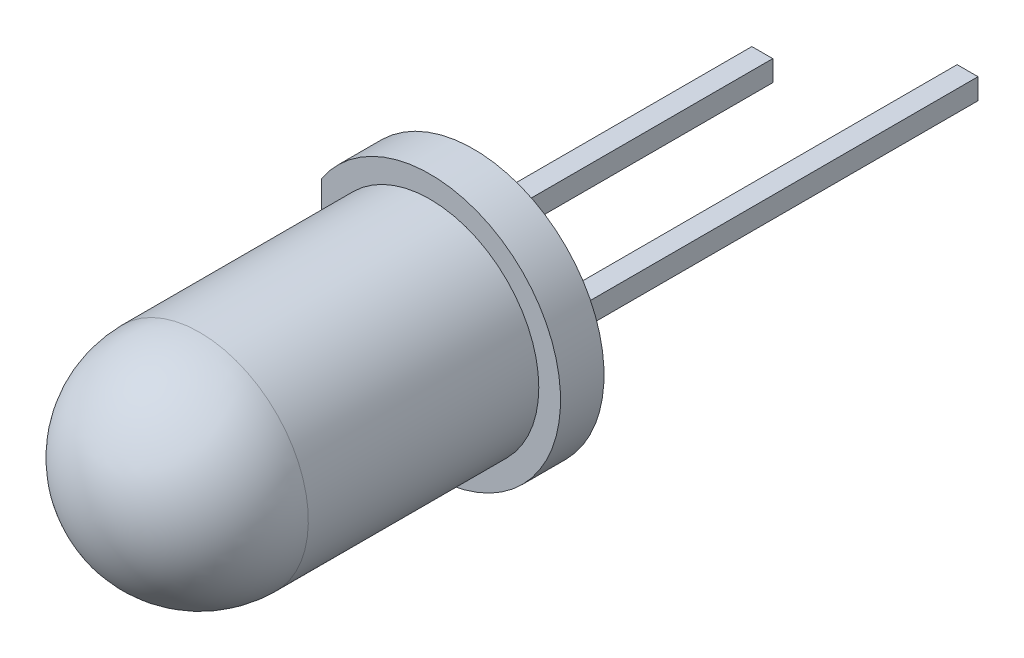
ISO-10303-21;
HEADER;
FILE_DESCRIPTION(('STEP AP214'),'2;1');
FILE_NAME('part.step','',(''),(''),'','','');
FILE_SCHEMA(('AUTOMOTIVE_DESIGN { 1 0 10303 214 1 1 1 1 }'));
ENDSEC;
DATA;
#1=APPLICATION_CONTEXT('core data for automotive mechanical design processes');
#2=APPLICATION_PROTOCOL_DEFINITION('international standard','automotive_design',2000,#1);
#3=PRODUCT_CONTEXT('',#1,'mechanical');
#4=PRODUCT('Part','Part','',(#3));
#5=PRODUCT_RELATED_PRODUCT_CATEGORY('part','',(#4));
#6=PRODUCT_DEFINITION_FORMATION('','',#4);
#7=PRODUCT_DEFINITION_CONTEXT('part definition',#1,'design');
#8=PRODUCT_DEFINITION('design','',#6,#7);
#9=PRODUCT_DEFINITION_SHAPE('','',#8);
#10=(LENGTH_UNIT() NAMED_UNIT(*) SI_UNIT(.MILLI.,.METRE.));
#11=(NAMED_UNIT(*) PLANE_ANGLE_UNIT() SI_UNIT($,.RADIAN.));
#12=(NAMED_UNIT(*) SI_UNIT($,.STERADIAN.) SOLID_ANGLE_UNIT());
#13=UNCERTAINTY_MEASURE_WITH_UNIT(LENGTH_MEASURE(1.E-05),#10,'distance_accuracy_value','');
#14=(GEOMETRIC_REPRESENTATION_CONTEXT(3) GLOBAL_UNCERTAINTY_ASSIGNED_CONTEXT((#13)) GLOBAL_UNIT_ASSIGNED_CONTEXT((#10,
#11,#12)) REPRESENTATION_CONTEXT('',''));
#15=CARTESIAN_POINT('',(0.,0.,0.));
#16=DIRECTION('',(0.,0.,1.));
#17=DIRECTION('',(1.,0.,0.));
#18=AXIS2_PLACEMENT_3D('',#15,#16,#17);
#19=CARTESIAN_POINT('',(-0.0499999999999997,0.,4.26666666666667));
#20=DIRECTION('',(0.,0.,1.));
#21=DIRECTION('',(-1.,0.,0.));
#22=AXIS2_PLACEMENT_3D('',#19,#20,#21);
#23=SPHERICAL_SURFACE('',#22,0.566666666666667);
#24=CARTESIAN_POINT('',(-0.0499999999999997,-0.24,4.26666666666667));
#25=DIRECTION('',(0.,1.,0.));
#26=DIRECTION('',(0.,0.,1.));
#27=AXIS2_PLACEMENT_3D('',#24,#25,#26);
#28=CIRCLE('',#27,0.513333333333333);
#29=CARTESIAN_POINT('',(-0.488634243989226,-0.24,4.));
#30=VERTEX_POINT('',#29);
#31=CARTESIAN_POINT('',(0.388634243989226,-0.24,4.));
#32=VERTEX_POINT('',#31);
#33=EDGE_CURVE('E188',#30,#32,#28,.F.);
#34=ORIENTED_EDGE('',*,*,#33,.T.);
#35=CARTESIAN_POINT('',(-0.0499999999999997,0.,4.));
#36=DIRECTION('',(0.,0.,1.));
#37=DIRECTION('',(1.,0.,0.));
#38=AXIS2_PLACEMENT_3D('',#35,#36,#37);
#39=CIRCLE('',#38,0.5);
#40=EDGE_CURVE('E67',#30,#32,#39,.T.);
#41=ORIENTED_EDGE('',*,*,#40,.F.);
#42=EDGE_LOOP('',(#34,#41));
#43=FACE_BOUND('',#42,.T.);
#44=ADVANCED_FACE('F58',(#43),#23,.T.);
#45=CARTESIAN_POINT('',(0.388634243989226,0.24,4.));
#46=VERTEX_POINT('',#45);
#47=CARTESIAN_POINT('',(-0.488634243989226,0.24,4.));
#48=VERTEX_POINT('',#47);
#49=EDGE_CURVE('E12',#46,#48,#39,.T.);
#50=ORIENTED_EDGE('',*,*,#49,.F.);
#51=CARTESIAN_POINT('',(-0.0499999999999997,0.24,4.26666666666667));
#52=DIRECTION('',(0.,1.,0.));
#53=DIRECTION('',(0.,0.,1.));
#54=AXIS2_PLACEMENT_3D('',#51,#52,#53);
#55=CIRCLE('',#54,0.513333333333333);
#56=EDGE_CURVE('E214',#48,#46,#55,.F.);
#57=ORIENTED_EDGE('',*,*,#56,.F.);
#58=EDGE_LOOP('',(#50,#57));
#59=FACE_BOUND('',#58,.T.);
#60=ADVANCED_FACE('F60',(#59),#23,.T.);
#61=CARTESIAN_POINT('',(-0.55,0.,4.));
#62=DIRECTION('',(0.,0.,-1.));
#63=DIRECTION('',(-1.,0.,0.));
#64=AXIS2_PLACEMENT_3D('',#61,#62,#63);
#65=PLANE('',#64);
#66=CARTESIAN_POINT('',(-0.0499999999999997,0.,4.));
#67=DIRECTION('',(0.,0.,1.));
#68=DIRECTION('',(1.,0.,0.));
#69=AXIS2_PLACEMENT_3D('',#66,#67,#68);
#70=CIRCLE('',#69,0.2);
#71=CARTESIAN_POINT('',(0.15,0.,4.));
#72=VERTEX_POINT('',#71);
#73=EDGE_CURVE('E250',#72,#72,#70,.T.);
#74=ORIENTED_EDGE('',*,*,#73,.F.);
#75=EDGE_LOOP('',(#74));
#76=FACE_BOUND('',#75,.T.);
#77=ORIENTED_EDGE('',*,*,#49,.T.);
#78=DIRECTION('',(1.,0.,0.));
#79=VECTOR('',#78,1.);
#80=CARTESIAN_POINT('',(-1.3,0.24,4.));
#81=LINE('',#80,#79);
#82=CARTESIAN_POINT('',(-1.3,0.24,4.));
#83=VERTEX_POINT('',#82);
#84=EDGE_CURVE('E113',#83,#48,#81,.T.);
#85=ORIENTED_EDGE('',*,*,#84,.F.);
#86=DIRECTION('',(0.,-1.,0.));
#87=VECTOR('',#86,1.);
#88=CARTESIAN_POINT('',(-1.3,0.24,4.));
#89=LINE('',#88,#87);
#90=CARTESIAN_POINT('',(-1.3,-0.24,4.));
#91=VERTEX_POINT('',#90);
#92=EDGE_CURVE('E186',#83,#91,#89,.T.);
#93=ORIENTED_EDGE('',*,*,#92,.T.);
#94=DIRECTION('',(1.,0.,0.));
#95=VECTOR('',#94,1.);
#96=CARTESIAN_POINT('',(-1.3,-0.24,4.));
#97=LINE('',#96,#95);
#98=EDGE_CURVE('E74',#91,#30,#97,.T.);
#99=ORIENTED_EDGE('',*,*,#98,.T.);
#100=ORIENTED_EDGE('',*,*,#40,.T.);
#101=CARTESIAN_POINT('',(1.2,-0.24,4.));
#102=VERTEX_POINT('',#101);
#103=EDGE_CURVE('E165',#32,#102,#97,.T.);
#104=ORIENTED_EDGE('',*,*,#103,.T.);
#105=DIRECTION('',(0.,-1.,0.));
#106=VECTOR('',#105,1.);
#107=CARTESIAN_POINT('',(1.2,0.24,4.));
#108=LINE('',#107,#106);
#109=CARTESIAN_POINT('',(1.2,0.24,4.));
#110=VERTEX_POINT('',#109);
#111=EDGE_CURVE('E143',#110,#102,#108,.T.);
#112=ORIENTED_EDGE('',*,*,#111,.F.);
#113=EDGE_CURVE('E129',#46,#110,#81,.T.);
#114=ORIENTED_EDGE('',*,*,#113,.F.);
#115=EDGE_LOOP('',(#77,#85,#93,#99,#100,#104,#112,#114));
#116=FACE_BOUND('',#115,.T.);
#117=ADVANCED_FACE('F197',(#76,#116),#65,.F.);
#118=CARTESIAN_POINT('',(0.,0.24,0.));
#119=DIRECTION('',(0.,1.,0.));
#120=DIRECTION('',(0.,0.,1.));
#121=AXIS2_PLACEMENT_3D('',#118,#119,#120);
#122=PLANE('',#121);
#123=ORIENTED_EDGE('',*,*,#84,.T.);
#124=ORIENTED_EDGE('',*,*,#56,.T.);
#125=ORIENTED_EDGE('',*,*,#113,.T.);
#126=DIRECTION('',(-0.508148861978286,0.,-0.861269257590315));
#127=VECTOR('',#126,1.);
#128=CARTESIAN_POINT('',(1.2,0.24,4.));
#129=LINE('',#128,#127);
#130=CARTESIAN_POINT('',(0.0199999999999998,0.24,2.));
#131=VERTEX_POINT('',#130);
#132=EDGE_CURVE('E120',#110,#131,#129,.T.);
#133=ORIENTED_EDGE('',*,*,#132,.T.);
#134=DIRECTION('',(-1.,0.,0.));
#135=VECTOR('',#134,1.);
#136=CARTESIAN_POINT('',(0.0199999999999998,0.24,2.));
#137=LINE('',#136,#135);
#138=CARTESIAN_POINT('',(-1.12,0.24,2.));
#139=VERTEX_POINT('',#138);
#140=EDGE_CURVE('E125',#131,#139,#137,.T.);
#141=ORIENTED_EDGE('',*,*,#140,.T.);
#142=DIRECTION('',(0.,0.,-1.));
#143=VECTOR('',#142,1.);
#144=CARTESIAN_POINT('',(-1.12,0.24,2.));
#145=LINE('',#144,#143);
#146=CARTESIAN_POINT('',(-1.12,0.24,-8.));
#147=VERTEX_POINT('',#146);
#148=EDGE_CURVE('E150',#139,#147,#145,.T.);
#149=ORIENTED_EDGE('',*,*,#148,.T.);
#150=DIRECTION('',(1.,0.,0.));
#151=VECTOR('',#150,1.);
#152=CARTESIAN_POINT('',(-1.12,0.24,-8.));
#153=LINE('',#152,#151);
#154=CARTESIAN_POINT('',(-1.6,0.24,-8.));
#155=VERTEX_POINT('',#154);
#156=EDGE_CURVE('E166',#155,#147,#153,.T.);
#157=ORIENTED_EDGE('',*,*,#156,.F.);
#158=DIRECTION('',(0.,0.,1.));
#159=VECTOR('',#158,1.);
#160=CARTESIAN_POINT('',(-1.6,0.24,0.));
#161=LINE('',#160,#159);
#162=CARTESIAN_POINT('',(-1.6,0.24,3.5));
#163=VERTEX_POINT('',#162);
#164=EDGE_CURVE('E83',#155,#163,#161,.T.);
#165=ORIENTED_EDGE('',*,*,#164,.T.);
#166=DIRECTION('',(0.514495755427526,0.,0.857492925712544));
#167=VECTOR('',#166,1.);
#168=CARTESIAN_POINT('',(-1.6,0.24,3.5));
#169=LINE('',#168,#167);
#170=EDGE_CURVE('E179',#163,#83,#169,.T.);
#171=ORIENTED_EDGE('',*,*,#170,.T.);
#172=EDGE_LOOP('',(#123,#124,#125,#133,#141,#149,#157,#165,#171));
#173=FACE_BOUND('',#172,.T.);
#174=ADVANCED_FACE('F122',(#173),#122,.T.);
#175=CARTESIAN_POINT('',(0.,-0.24,0.));
#176=DIRECTION('',(0.,1.,0.));
#177=DIRECTION('',(0.,0.,1.));
#178=AXIS2_PLACEMENT_3D('',#175,#176,#177);
#179=PLANE('',#178);
#180=ORIENTED_EDGE('',*,*,#33,.F.);
#181=ORIENTED_EDGE('',*,*,#98,.F.);
#182=DIRECTION('',(0.514495755427526,0.,0.857492925712544));
#183=VECTOR('',#182,1.);
#184=CARTESIAN_POINT('',(-1.6,-0.24,3.5));
#185=LINE('',#184,#183);
#186=CARTESIAN_POINT('',(-1.6,-0.24,3.5));
#187=VERTEX_POINT('',#186);
#188=EDGE_CURVE('E161',#187,#91,#185,.T.);
#189=ORIENTED_EDGE('',*,*,#188,.F.);
#190=DIRECTION('',(0.,0.,1.));
#191=VECTOR('',#190,1.);
#192=CARTESIAN_POINT('',(-1.6,-0.24,0.));
#193=LINE('',#192,#191);
#194=CARTESIAN_POINT('',(-1.6,-0.24,-8.));
#195=VERTEX_POINT('',#194);
#196=EDGE_CURVE('E107',#195,#187,#193,.T.);
#197=ORIENTED_EDGE('',*,*,#196,.F.);
#198=DIRECTION('',(-1.,0.,0.));
#199=VECTOR('',#198,1.);
#200=CARTESIAN_POINT('',(-1.12,-0.24,-8.));
#201=LINE('',#200,#199);
#202=CARTESIAN_POINT('',(-1.12,-0.24,-8.));
#203=VERTEX_POINT('',#202);
#204=EDGE_CURVE('E235',#203,#195,#201,.T.);
#205=ORIENTED_EDGE('',*,*,#204,.F.);
#206=DIRECTION('',(0.,0.,-1.));
#207=VECTOR('',#206,1.);
#208=CARTESIAN_POINT('',(-1.12,-0.24,2.));
#209=LINE('',#208,#207);
#210=CARTESIAN_POINT('',(-1.12,-0.24,2.));
#211=VERTEX_POINT('',#210);
#212=EDGE_CURVE('E173',#211,#203,#209,.T.);
#213=ORIENTED_EDGE('',*,*,#212,.F.);
#214=DIRECTION('',(-1.,0.,0.));
#215=VECTOR('',#214,1.);
#216=CARTESIAN_POINT('',(0.0199999999999998,-0.24,2.));
#217=LINE('',#216,#215);
#218=CARTESIAN_POINT('',(0.0199999999999998,-0.24,2.));
#219=VERTEX_POINT('',#218);
#220=EDGE_CURVE('E170',#219,#211,#217,.T.);
#221=ORIENTED_EDGE('',*,*,#220,.F.);
#222=DIRECTION('',(-0.508148861978286,0.,-0.861269257590315));
#223=VECTOR('',#222,1.);
#224=CARTESIAN_POINT('',(1.2,-0.24,4.));
#225=LINE('',#224,#223);
#226=EDGE_CURVE('E139',#102,#219,#225,.T.);
#227=ORIENTED_EDGE('',*,*,#226,.F.);
#228=ORIENTED_EDGE('',*,*,#103,.F.);
#229=EDGE_LOOP('',(#180,#181,#189,#197,#205,#213,#221,#227,#228));
#230=FACE_BOUND('',#229,.T.);
#231=ADVANCED_FACE('F274',(#230),#179,.F.);
#232=CARTESIAN_POINT('',(-1.6,0.24,3.5));
#233=DIRECTION('',(0.857492925712544,0.,-0.514495755427526));
#234=DIRECTION('',(-0.514495755427526,0.,-0.857492925712544));
#235=AXIS2_PLACEMENT_3D('',#232,#233,#234);
#236=PLANE('',#235);
#237=ORIENTED_EDGE('',*,*,#188,.T.);
#238=ORIENTED_EDGE('',*,*,#92,.F.);
#239=ORIENTED_EDGE('',*,*,#170,.F.);
#240=DIRECTION('',(0.,-1.,0.));
#241=VECTOR('',#240,1.);
#242=CARTESIAN_POINT('',(-1.6,0.24,3.5));
#243=LINE('',#242,#241);
#244=EDGE_CURVE('E160',#163,#187,#243,.T.);
#245=ORIENTED_EDGE('',*,*,#244,.T.);
#246=EDGE_LOOP('',(#237,#238,#239,#245));
#247=FACE_BOUND('',#246,.T.);
#248=ADVANCED_FACE('F277',(#247),#236,.F.);
#249=CARTESIAN_POINT('',(1.2,0.24,4.));
#250=DIRECTION('',(-0.861269257590315,0.,0.508148861978286));
#251=DIRECTION('',(0.508148861978286,0.,0.861269257590315));
#252=AXIS2_PLACEMENT_3D('',#249,#250,#251);
#253=PLANE('',#252);
#254=ORIENTED_EDGE('',*,*,#226,.T.);
#255=DIRECTION('',(0.,-1.,0.));
#256=VECTOR('',#255,1.);
#257=CARTESIAN_POINT('',(0.0199999999999998,0.24,2.));
#258=LINE('',#257,#256);
#259=EDGE_CURVE('E136',#131,#219,#258,.T.);
#260=ORIENTED_EDGE('',*,*,#259,.F.);
#261=ORIENTED_EDGE('',*,*,#132,.F.);
#262=ORIENTED_EDGE('',*,*,#111,.T.);
#263=EDGE_LOOP('',(#254,#260,#261,#262));
#264=FACE_BOUND('',#263,.T.);
#265=ADVANCED_FACE('F137',(#264),#253,.F.);
#266=CARTESIAN_POINT('',(0.0199999999999998,0.24,2.));
#267=DIRECTION('',(0.,0.,1.));
#268=DIRECTION('',(1.,0.,0.));
#269=AXIS2_PLACEMENT_3D('',#266,#267,#268);
#270=PLANE('',#269);
#271=ORIENTED_EDGE('',*,*,#220,.T.);
#272=DIRECTION('',(0.,-1.,0.));
#273=VECTOR('',#272,1.);
#274=CARTESIAN_POINT('',(-1.12,0.24,2.));
#275=LINE('',#274,#273);
#276=EDGE_CURVE('E144',#139,#211,#275,.T.);
#277=ORIENTED_EDGE('',*,*,#276,.F.);
#278=ORIENTED_EDGE('',*,*,#140,.F.);
#279=ORIENTED_EDGE('',*,*,#259,.T.);
#280=EDGE_LOOP('',(#271,#277,#278,#279));
#281=FACE_BOUND('',#280,.T.);
#282=ADVANCED_FACE('F146',(#281),#270,.F.);
#283=CARTESIAN_POINT('',(-1.12,0.24,2.));
#284=DIRECTION('',(-1.,0.,0.));
#285=DIRECTION('',(0.,0.,1.));
#286=AXIS2_PLACEMENT_3D('',#283,#284,#285);
#287=PLANE('',#286);
#288=ORIENTED_EDGE('',*,*,#212,.T.);
#289=DIRECTION('',(0.,-1.,0.));
#290=VECTOR('',#289,1.);
#291=CARTESIAN_POINT('',(-1.12,-0.24,-8.));
#292=LINE('',#291,#290);
#293=EDGE_CURVE('E229',#147,#203,#292,.T.);
#294=ORIENTED_EDGE('',*,*,#293,.F.);
#295=ORIENTED_EDGE('',*,*,#148,.F.);
#296=ORIENTED_EDGE('',*,*,#276,.T.);
#297=EDGE_LOOP('',(#288,#294,#295,#296));
#298=FACE_BOUND('',#297,.T.);
#299=ADVANCED_FACE('F232',(#298),#287,.F.);
#300=CARTESIAN_POINT('',(-1.6,0.24,0.));
#301=DIRECTION('',(1.,0.,0.));
#302=DIRECTION('',(0.,0.,-1.));
#303=AXIS2_PLACEMENT_3D('',#300,#301,#302);
#304=PLANE('',#303);
#305=ORIENTED_EDGE('',*,*,#196,.T.);
#306=ORIENTED_EDGE('',*,*,#244,.F.);
#307=ORIENTED_EDGE('',*,*,#164,.F.);
#308=DIRECTION('',(0.,1.,0.));
#309=VECTOR('',#308,1.);
#310=CARTESIAN_POINT('',(-1.6,-0.24,-8.));
#311=LINE('',#310,#309);
#312=EDGE_CURVE('E230',#195,#155,#311,.T.);
#313=ORIENTED_EDGE('',*,*,#312,.F.);
#314=EDGE_LOOP('',(#305,#306,#307,#313));
#315=FACE_BOUND('',#314,.T.);
#316=ADVANCED_FACE('F269',(#315),#304,.F.);
#317=CARTESIAN_POINT('',(0.,0.,-8.));
#318=DIRECTION('',(0.,0.,1.));
#319=DIRECTION('',(1.,0.,0.));
#320=AXIS2_PLACEMENT_3D('',#317,#318,#319);
#321=PLANE('',#320);
#322=ORIENTED_EDGE('',*,*,#293,.T.);
#323=ORIENTED_EDGE('',*,*,#204,.T.);
#324=ORIENTED_EDGE('',*,*,#312,.T.);
#325=ORIENTED_EDGE('',*,*,#156,.T.);
#326=EDGE_LOOP('',(#322,#323,#324,#325));
#327=FACE_BOUND('',#326,.T.);
#328=ADVANCED_FACE('F227',(#327),#321,.F.);
#329=CARTESIAN_POINT('',(-0.0499999999999997,0.,3.9));
#330=DIRECTION('',(0.,0.,1.));
#331=DIRECTION('',(1.,0.,0.));
#332=AXIS2_PLACEMENT_3D('',#329,#330,#331);
#333=CYLINDRICAL_SURFACE('',#332,0.2);
#334=CARTESIAN_POINT('',(-0.0499999999999997,0.,3.9));
#335=DIRECTION('',(0.,0.,1.));
#336=DIRECTION('',(1.,0.,0.));
#337=AXIS2_PLACEMENT_3D('',#334,#335,#336);
#338=CIRCLE('',#337,0.2);
#339=CARTESIAN_POINT('',(0.15,0.,3.9));
#340=VERTEX_POINT('',#339);
#341=EDGE_CURVE('E239',#340,#340,#338,.T.);
#342=ORIENTED_EDGE('',*,*,#341,.F.);
#343=EDGE_LOOP('',(#342));
#344=FACE_BOUND('',#343,.T.);
#345=ORIENTED_EDGE('',*,*,#73,.T.);
#346=EDGE_LOOP('',(#345));
#347=FACE_BOUND('',#346,.T.);
#348=ADVANCED_FACE('F261',(#344,#347),#333,.F.);
#349=CARTESIAN_POINT('',(-0.0499999999999997,0.,3.9));
#350=DIRECTION('',(0.,0.,1.));
#351=DIRECTION('',(1.,0.,0.));
#352=AXIS2_PLACEMENT_3D('',#349,#350,#351);
#353=PLANE('',#352);
#354=ORIENTED_EDGE('',*,*,#341,.T.);
#355=EDGE_LOOP('',(#354));
#356=FACE_BOUND('',#355,.T.);
#357=ADVANCED_FACE('F259',(#356),#353,.T.);
#358=CLOSED_SHELL('',(#44,#60,#117,#174,#231,#248,#265,#282,#299,#316,#328,#348,#357));
#359=MANIFOLD_SOLID_BREP('B2',#358);
#360=CARTESIAN_POINT('',(1.12,0.24,2.));
#361=DIRECTION('',(0.,0.,1.));
#362=DIRECTION('',(1.,0.,0.));
#363=AXIS2_PLACEMENT_3D('',#360,#361,#362);
#364=PLANE('',#363);
#365=DIRECTION('',(-1.,0.,0.));
#366=VECTOR('',#365,1.);
#367=CARTESIAN_POINT('',(1.12,-0.24,2.));
#368=LINE('',#367,#366);
#369=CARTESIAN_POINT('',(1.12,-0.24,2.));
#370=VERTEX_POINT('',#369);
#371=CARTESIAN_POINT('',(0.22,-0.24,2.));
#372=VERTEX_POINT('',#371);
#373=EDGE_CURVE('E512',#370,#372,#368,.T.);
#374=ORIENTED_EDGE('',*,*,#373,.T.);
#375=DIRECTION('',(0.,-1.,0.));
#376=VECTOR('',#375,1.);
#377=CARTESIAN_POINT('',(0.22,0.24,2.));
#378=LINE('',#377,#376);
#379=CARTESIAN_POINT('',(0.22,0.24,2.));
#380=VERTEX_POINT('',#379);
#381=EDGE_CURVE('E56',#380,#372,#378,.T.);
#382=ORIENTED_EDGE('',*,*,#381,.F.);
#383=DIRECTION('',(-1.,0.,0.));
#384=VECTOR('',#383,1.);
#385=CARTESIAN_POINT('',(1.12,0.24,2.));
#386=LINE('',#385,#384);
#387=CARTESIAN_POINT('',(1.12,0.24,2.));
#388=VERTEX_POINT('',#387);
#389=EDGE_CURVE('E513',#388,#380,#386,.T.);
#390=ORIENTED_EDGE('',*,*,#389,.F.);
#391=DIRECTION('',(0.,-1.,0.));
#392=VECTOR('',#391,1.);
#393=CARTESIAN_POINT('',(1.12,0.24,2.));
#394=LINE('',#393,#392);
#395=EDGE_CURVE('E522',#388,#370,#394,.T.);
#396=ORIENTED_EDGE('',*,*,#395,.T.);
#397=EDGE_LOOP('',(#374,#382,#390,#396));
#398=FACE_BOUND('',#397,.T.);
#399=ADVANCED_FACE('F420',(#398),#364,.F.);
#400=CARTESIAN_POINT('',(0.22,0.24,2.));
#401=DIRECTION('',(0.861269257590315,0.,-0.508148861978286));
#402=DIRECTION('',(-0.508148861978286,0.,-0.861269257590315));
#403=AXIS2_PLACEMENT_3D('',#400,#401,#402);
#404=PLANE('',#403);
#405=DIRECTION('',(0.508148861978286,0.,0.861269257590315));
#406=VECTOR('',#405,1.);
#407=CARTESIAN_POINT('',(0.22,-0.24,2.));
#408=LINE('',#407,#406);
#409=CARTESIAN_POINT('',(1.4,-0.24,4.));
#410=VERTEX_POINT('',#409);
#411=EDGE_CURVE('E526',#372,#410,#408,.T.);
#412=ORIENTED_EDGE('',*,*,#411,.T.);
#413=DIRECTION('',(0.,-1.,0.));
#414=VECTOR('',#413,1.);
#415=CARTESIAN_POINT('',(1.4,0.24,4.));
#416=LINE('',#415,#414);
#417=CARTESIAN_POINT('',(1.4,0.24,4.));
#418=VERTEX_POINT('',#417);
#419=EDGE_CURVE('E429',#418,#410,#416,.T.);
#420=ORIENTED_EDGE('',*,*,#419,.F.);
#421=DIRECTION('',(0.508148861978286,0.,0.861269257590315));
#422=VECTOR('',#421,1.);
#423=CARTESIAN_POINT('',(0.22,0.24,2.));
#424=LINE('',#423,#422);
#425=EDGE_CURVE('E470',#380,#418,#424,.T.);
#426=ORIENTED_EDGE('',*,*,#425,.F.);
#427=ORIENTED_EDGE('',*,*,#381,.T.);
#428=EDGE_LOOP('',(#412,#420,#426,#427));
#429=FACE_BOUND('',#428,.T.);
#430=ADVANCED_FACE('F548',(#429),#404,.F.);
#431=CARTESIAN_POINT('',(1.4,0.24,4.));
#432=DIRECTION('',(0.,0.,-1.));
#433=DIRECTION('',(-1.,0.,0.));
#434=AXIS2_PLACEMENT_3D('',#431,#432,#433);
#435=PLANE('',#434);
#436=DIRECTION('',(1.,0.,0.));
#437=VECTOR('',#436,1.);
#438=CARTESIAN_POINT('',(1.4,-0.24,4.));
#439=LINE('',#438,#437);
#440=CARTESIAN_POINT('',(1.6,-0.24,4.));
#441=VERTEX_POINT('',#440);
#442=EDGE_CURVE('E456',#410,#441,#439,.T.);
#443=ORIENTED_EDGE('',*,*,#442,.T.);
#444=DIRECTION('',(0.,-1.,0.));
#445=VECTOR('',#444,1.);
#446=CARTESIAN_POINT('',(1.6,0.24,4.));
#447=LINE('',#446,#445);
#448=CARTESIAN_POINT('',(1.6,0.24,4.));
#449=VERTEX_POINT('',#448);
#450=EDGE_CURVE('E537',#449,#441,#447,.T.);
#451=ORIENTED_EDGE('',*,*,#450,.F.);
#452=DIRECTION('',(1.,0.,0.));
#453=VECTOR('',#452,1.);
#454=CARTESIAN_POINT('',(1.4,0.24,4.));
#455=LINE('',#454,#453);
#456=EDGE_CURVE('E487',#418,#449,#455,.T.);
#457=ORIENTED_EDGE('',*,*,#456,.F.);
#458=ORIENTED_EDGE('',*,*,#419,.T.);
#459=EDGE_LOOP('',(#443,#451,#457,#458));
#460=FACE_BOUND('',#459,.T.);
#461=ADVANCED_FACE('F540',(#460),#435,.F.);
#462=CARTESIAN_POINT('',(1.6,0.24,4.));
#463=DIRECTION('',(-1.,0.,0.));
#464=DIRECTION('',(0.,0.,1.));
#465=AXIS2_PLACEMENT_3D('',#462,#463,#464);
#466=PLANE('',#465);
#467=DIRECTION('',(0.,0.,-1.));
#468=VECTOR('',#467,1.);
#469=CARTESIAN_POINT('',(1.6,-0.24,4.));
#470=LINE('',#469,#468);
#471=CARTESIAN_POINT('',(1.6,-0.24,-10.));
#472=VERTEX_POINT('',#471);
#473=EDGE_CURVE('E495',#441,#472,#470,.T.);
#474=ORIENTED_EDGE('',*,*,#473,.T.);
#475=DIRECTION('',(0.,-1.,0.));
#476=VECTOR('',#475,1.);
#477=CARTESIAN_POINT('',(1.6,0.24,-10.));
#478=LINE('',#477,#476);
#479=CARTESIAN_POINT('',(1.6,0.24,-10.));
#480=VERTEX_POINT('',#479);
#481=EDGE_CURVE('E492',#480,#472,#478,.T.);
#482=ORIENTED_EDGE('',*,*,#481,.F.);
#483=DIRECTION('',(0.,0.,-1.));
#484=VECTOR('',#483,1.);
#485=CARTESIAN_POINT('',(1.6,0.24,4.));
#486=LINE('',#485,#484);
#487=EDGE_CURVE('E481',#449,#480,#486,.T.);
#488=ORIENTED_EDGE('',*,*,#487,.F.);
#489=ORIENTED_EDGE('',*,*,#450,.T.);
#490=EDGE_LOOP('',(#474,#482,#488,#489));
#491=FACE_BOUND('',#490,.T.);
#492=ADVANCED_FACE('F493',(#491),#466,.F.);
#493=CARTESIAN_POINT('',(1.12,0.24,0.));
#494=DIRECTION('',(1.,0.,0.));
#495=DIRECTION('',(0.,0.,-1.));
#496=AXIS2_PLACEMENT_3D('',#493,#494,#495);
#497=PLANE('',#496);
#498=DIRECTION('',(0.,0.,1.));
#499=VECTOR('',#498,1.);
#500=CARTESIAN_POINT('',(1.12,-0.24,0.));
#501=LINE('',#500,#499);
#502=CARTESIAN_POINT('',(1.12,-0.24,-10.));
#503=VERTEX_POINT('',#502);
#504=EDGE_CURVE('E463',#503,#370,#501,.T.);
#505=ORIENTED_EDGE('',*,*,#504,.T.);
#506=ORIENTED_EDGE('',*,*,#395,.F.);
#507=DIRECTION('',(0.,0.,1.));
#508=VECTOR('',#507,1.);
#509=CARTESIAN_POINT('',(1.12,0.24,0.));
#510=LINE('',#509,#508);
#511=CARTESIAN_POINT('',(1.12,0.24,-10.));
#512=VERTEX_POINT('',#511);
#513=EDGE_CURVE('E437',#512,#388,#510,.T.);
#514=ORIENTED_EDGE('',*,*,#513,.F.);
#515=DIRECTION('',(0.,1.,0.));
#516=VECTOR('',#515,1.);
#517=CARTESIAN_POINT('',(1.12,-0.24,-10.));
#518=LINE('',#517,#516);
#519=EDGE_CURVE('E504',#503,#512,#518,.T.);
#520=ORIENTED_EDGE('',*,*,#519,.F.);
#521=EDGE_LOOP('',(#505,#506,#514,#520));
#522=FACE_BOUND('',#521,.T.);
#523=ADVANCED_FACE('F544',(#522),#497,.F.);
#524=CARTESIAN_POINT('',(0.,0.24,0.));
#525=DIRECTION('',(0.,-1.,0.));
#526=DIRECTION('',(0.,0.,-1.));
#527=AXIS2_PLACEMENT_3D('',#524,#525,#526);
#528=PLANE('',#527);
#529=ORIENTED_EDGE('',*,*,#389,.T.);
#530=ORIENTED_EDGE('',*,*,#425,.T.);
#531=ORIENTED_EDGE('',*,*,#456,.T.);
#532=ORIENTED_EDGE('',*,*,#487,.T.);
#533=DIRECTION('',(1.,0.,0.));
#534=VECTOR('',#533,1.);
#535=CARTESIAN_POINT('',(1.12,0.24,-10.));
#536=LINE('',#535,#534);
#537=EDGE_CURVE('E485',#512,#480,#536,.T.);
#538=ORIENTED_EDGE('',*,*,#537,.F.);
#539=ORIENTED_EDGE('',*,*,#513,.T.);
#540=EDGE_LOOP('',(#529,#530,#531,#532,#538,#539));
#541=FACE_BOUND('',#540,.T.);
#542=ADVANCED_FACE('F483',(#541),#528,.F.);
#543=CARTESIAN_POINT('',(0.,-0.24,0.));
#544=DIRECTION('',(0.,-1.,0.));
#545=DIRECTION('',(0.,0.,-1.));
#546=AXIS2_PLACEMENT_3D('',#543,#544,#545);
#547=PLANE('',#546);
#548=ORIENTED_EDGE('',*,*,#373,.F.);
#549=ORIENTED_EDGE('',*,*,#504,.F.);
#550=DIRECTION('',(-1.,0.,0.));
#551=VECTOR('',#550,1.);
#552=CARTESIAN_POINT('',(1.6,-0.24,-10.));
#553=LINE('',#552,#551);
#554=EDGE_CURVE('E500',#472,#503,#553,.T.);
#555=ORIENTED_EDGE('',*,*,#554,.F.);
#556=ORIENTED_EDGE('',*,*,#473,.F.);
#557=ORIENTED_EDGE('',*,*,#442,.F.);
#558=ORIENTED_EDGE('',*,*,#411,.F.);
#559=EDGE_LOOP('',(#548,#549,#555,#556,#557,#558));
#560=FACE_BOUND('',#559,.T.);
#561=ADVANCED_FACE('F543',(#560),#547,.T.);
#562=CARTESIAN_POINT('',(0.,0.,-10.));
#563=DIRECTION('',(0.,0.,-1.));
#564=DIRECTION('',(-1.,0.,0.));
#565=AXIS2_PLACEMENT_3D('',#562,#563,#564);
#566=PLANE('',#565);
#567=ORIENTED_EDGE('',*,*,#537,.T.);
#568=ORIENTED_EDGE('',*,*,#481,.T.);
#569=ORIENTED_EDGE('',*,*,#554,.T.);
#570=ORIENTED_EDGE('',*,*,#519,.T.);
#571=EDGE_LOOP('',(#567,#568,#569,#570));
#572=FACE_BOUND('',#571,.T.);
#573=ADVANCED_FACE('F503',(#572),#566,.T.);
#574=CLOSED_SHELL('',(#399,#430,#461,#492,#523,#542,#561,#573));
#575=MANIFOLD_SOLID_BREP('B6',#574);
#576=CARTESIAN_POINT('',(0.,0.,1.));
#577=DIRECTION('',(0.,0.,-1.));
#578=DIRECTION('',(-1.,0.,0.));
#579=AXIS2_PLACEMENT_3D('',#576,#577,#578);
#580=CYLINDRICAL_SURFACE('',#579,3.);
#581=CARTESIAN_POINT('',(0.,0.,1.));
#582=DIRECTION('',(0.,0.,1.));
#583=DIRECTION('',(1.,0.,0.));
#584=AXIS2_PLACEMENT_3D('',#581,#582,#583);
#585=CIRCLE('',#584,3.);
#586=CARTESIAN_POINT('',(-2.5,-1.6583123951777,1.));
#587=VERTEX_POINT('',#586);
#588=CARTESIAN_POINT('',(-2.5,1.6583123951777,1.));
#589=VERTEX_POINT('',#588);
#590=EDGE_CURVE('E659',#587,#589,#585,.T.);
#591=ORIENTED_EDGE('',*,*,#590,.F.);
#592=DIRECTION('',(0.,0.,-1.));
#593=VECTOR('',#592,1.);
#594=CARTESIAN_POINT('',(-2.5,-1.6583123951777,4.35410196624969));
#595=LINE('',#594,#593);
#596=CARTESIAN_POINT('',(-2.5,-1.6583123951777,0.));
#597=VERTEX_POINT('',#596);
#598=EDGE_CURVE('E886',#587,#597,#595,.T.);
#599=ORIENTED_EDGE('',*,*,#598,.T.);
#600=CARTESIAN_POINT('',(0.,0.,0.));
#601=DIRECTION('',(0.,0.,1.));
#602=DIRECTION('',(1.,0.,0.));
#603=AXIS2_PLACEMENT_3D('',#600,#601,#602);
#604=CIRCLE('',#603,3.);
#605=CARTESIAN_POINT('',(-2.5,1.6583123951777,0.));
#606=VERTEX_POINT('',#605);
#607=EDGE_CURVE('E897',#597,#606,#604,.T.);
#608=ORIENTED_EDGE('',*,*,#607,.T.);
#609=DIRECTION('',(0.,0.,-1.));
#610=VECTOR('',#609,1.);
#611=CARTESIAN_POINT('',(-2.5,1.6583123951777,4.35410196624969));
#612=LINE('',#611,#610);
#613=EDGE_CURVE('E890',#589,#606,#612,.T.);
#614=ORIENTED_EDGE('',*,*,#613,.F.);
#615=EDGE_LOOP('',(#591,#599,#608,#614));
#616=FACE_BOUND('',#615,.T.);
#617=ADVANCED_FACE('F651',(#616),#580,.T.);
#618=CARTESIAN_POINT('',(0.,0.,1.));
#619=DIRECTION('',(0.,0.,1.));
#620=DIRECTION('',(1.,0.,0.));
#621=AXIS2_PLACEMENT_3D('',#618,#619,#620);
#622=PLANE('',#621);
#623=DIRECTION('',(0.,-1.,0.));
#624=VECTOR('',#623,1.);
#625=CARTESIAN_POINT('',(-2.5,1.6583123951777,1.));
#626=LINE('',#625,#624);
#627=CARTESIAN_POINT('',(-2.5,0.,1.));
#628=VERTEX_POINT('',#627);
#629=EDGE_CURVE('E881',#628,#587,#626,.T.);
#630=ORIENTED_EDGE('',*,*,#629,.T.);
#631=ORIENTED_EDGE('',*,*,#590,.T.);
#632=EDGE_CURVE('E882',#589,#628,#626,.T.);
#633=ORIENTED_EDGE('',*,*,#632,.T.);
#634=CARTESIAN_POINT('',(0.,0.,1.));
#635=DIRECTION('',(0.,0.,1.));
#636=DIRECTION('',(1.,0.,0.));
#637=AXIS2_PLACEMENT_3D('',#634,#635,#636);
#638=CIRCLE('',#637,2.5);
#639=EDGE_CURVE('E418',#628,#628,#638,.T.);
#640=ORIENTED_EDGE('',*,*,#639,.F.);
#641=EDGE_LOOP('',(#630,#631,#633,#640));
#642=FACE_BOUND('',#641,.T.);
#643=ADVANCED_FACE('F915',(#642),#622,.T.);
#644=CARTESIAN_POINT('',(0.,0.,0.));
#645=DIRECTION('',(0.,0.,1.));
#646=DIRECTION('',(1.,0.,0.));
#647=AXIS2_PLACEMENT_3D('',#644,#645,#646);
#648=PLANE('',#647);
#649=DIRECTION('',(0.,1.,0.));
#650=VECTOR('',#649,1.);
#651=CARTESIAN_POINT('',(1.12,-0.24,0.));
#652=LINE('',#651,#650);
#653=CARTESIAN_POINT('',(1.12,-0.24,0.));
#654=VERTEX_POINT('',#653);
#655=CARTESIAN_POINT('',(1.12,0.24,0.));
#656=VERTEX_POINT('',#655);
#657=EDGE_CURVE('E766',#654,#656,#652,.T.);
#658=ORIENTED_EDGE('',*,*,#657,.F.);
#659=DIRECTION('',(-1.,0.,0.));
#660=VECTOR('',#659,1.);
#661=CARTESIAN_POINT('',(1.12,-0.24,0.));
#662=LINE('',#661,#660);
#663=CARTESIAN_POINT('',(1.6,-0.24,0.));
#664=VERTEX_POINT('',#663);
#665=EDGE_CURVE('E774',#664,#654,#662,.T.);
#666=ORIENTED_EDGE('',*,*,#665,.F.);
#667=DIRECTION('',(0.,1.,0.));
#668=VECTOR('',#667,1.);
#669=CARTESIAN_POINT('',(1.6,-0.24,0.));
#670=LINE('',#669,#668);
#671=CARTESIAN_POINT('',(1.6,0.24,0.));
#672=VERTEX_POINT('',#671);
#673=EDGE_CURVE('E836',#664,#672,#670,.T.);
#674=ORIENTED_EDGE('',*,*,#673,.T.);
#675=DIRECTION('',(-1.,0.,0.));
#676=VECTOR('',#675,1.);
#677=CARTESIAN_POINT('',(1.12,0.24,0.));
#678=LINE('',#677,#676);
#679=EDGE_CURVE('E789',#672,#656,#678,.T.);
#680=ORIENTED_EDGE('',*,*,#679,.T.);
#681=EDGE_LOOP('',(#658,#666,#674,#680));
#682=FACE_BOUND('',#681,.T.);
#683=DIRECTION('',(0.,1.,0.));
#684=VECTOR('',#683,1.);
#685=CARTESIAN_POINT('',(-1.6,-0.24,0.));
#686=LINE('',#685,#684);
#687=CARTESIAN_POINT('',(-1.6,-0.24,0.));
#688=VERTEX_POINT('',#687);
#689=CARTESIAN_POINT('',(-1.6,0.24,0.));
#690=VERTEX_POINT('',#689);
#691=EDGE_CURVE('E831',#688,#690,#686,.T.);
#692=ORIENTED_EDGE('',*,*,#691,.F.);
#693=DIRECTION('',(-1.,0.,0.));
#694=VECTOR('',#693,1.);
#695=CARTESIAN_POINT('',(-1.6,-0.24,0.));
#696=LINE('',#695,#694);
#697=CARTESIAN_POINT('',(-1.12,-0.24,0.));
#698=VERTEX_POINT('',#697);
#699=EDGE_CURVE('E802',#698,#688,#696,.T.);
#700=ORIENTED_EDGE('',*,*,#699,.F.);
#701=DIRECTION('',(0.,1.,0.));
#702=VECTOR('',#701,1.);
#703=CARTESIAN_POINT('',(-1.12,-0.24,0.));
#704=LINE('',#703,#702);
#705=CARTESIAN_POINT('',(-1.12,0.24,0.));
#706=VERTEX_POINT('',#705);
#707=EDGE_CURVE('E858',#698,#706,#704,.T.);
#708=ORIENTED_EDGE('',*,*,#707,.T.);
#709=DIRECTION('',(-1.,0.,0.));
#710=VECTOR('',#709,1.);
#711=CARTESIAN_POINT('',(-1.6,0.24,0.));
#712=LINE('',#711,#710);
#713=EDGE_CURVE('E832',#706,#690,#712,.T.);
#714=ORIENTED_EDGE('',*,*,#713,.T.);
#715=EDGE_LOOP('',(#692,#700,#708,#714));
#716=FACE_BOUND('',#715,.T.);
#717=ORIENTED_EDGE('',*,*,#607,.F.);
#718=DIRECTION('',(0.,-1.,0.));
#719=VECTOR('',#718,1.);
#720=CARTESIAN_POINT('',(-2.5,1.6583123951777,0.));
#721=LINE('',#720,#719);
#722=EDGE_CURVE('E862',#606,#597,#721,.T.);
#723=ORIENTED_EDGE('',*,*,#722,.F.);
#724=EDGE_LOOP('',(#717,#723));
#725=FACE_BOUND('',#724,.T.);
#726=ADVANCED_FACE('F787',(#682,#716,#725),#648,.F.);
#727=CARTESIAN_POINT('',(0.,0.,6.3));
#728=DIRECTION('',(0.,0.,-1.));
#729=DIRECTION('',(0.,1.,0.));
#730=AXIS2_PLACEMENT_3D('',#727,#728,#729);
#731=SPHERICAL_SURFACE('',#730,2.5);
#732=CARTESIAN_POINT('',(0.,0.,6.3));
#733=DIRECTION('',(0.,0.,-1.));
#734=DIRECTION('',(0.,1.,0.));
#735=AXIS2_PLACEMENT_3D('',#732,#733,#734);
#736=CIRCLE('',#735,2.5);
#737=CARTESIAN_POINT('',(0.,2.5,6.3));
#738=VERTEX_POINT('',#737);
#739=EDGE_CURVE('E893',#738,#738,#736,.T.);
#740=ORIENTED_EDGE('',*,*,#739,.F.);
#741=EDGE_LOOP('',(#740));
#742=FACE_BOUND('',#741,.T.);
#743=ADVANCED_FACE('F919',(#742),#731,.T.);
#744=CARTESIAN_POINT('',(0.,0.,1.));
#745=DIRECTION('',(0.,0.,-1.));
#746=DIRECTION('',(0.,1.,0.));
#747=AXIS2_PLACEMENT_3D('',#744,#745,#746);
#748=CYLINDRICAL_SURFACE('',#747,2.5);
#749=ORIENTED_EDGE('',*,*,#739,.T.);
#750=EDGE_LOOP('',(#749));
#751=FACE_BOUND('',#750,.T.);
#752=ORIENTED_EDGE('',*,*,#639,.T.);
#753=EDGE_LOOP('',(#752));
#754=FACE_BOUND('',#753,.T.);
#755=ADVANCED_FACE('F917',(#751,#754),#748,.T.);
#756=CARTESIAN_POINT('',(-2.5,1.6583123951777,4.35410196624969));
#757=DIRECTION('',(1.,0.,0.));
#758=DIRECTION('',(0.,0.,-1.));
#759=AXIS2_PLACEMENT_3D('',#756,#757,#758);
#760=PLANE('',#759);
#761=ORIENTED_EDGE('',*,*,#613,.T.);
#762=ORIENTED_EDGE('',*,*,#722,.T.);
#763=ORIENTED_EDGE('',*,*,#598,.F.);
#764=ORIENTED_EDGE('',*,*,#629,.F.);
#765=ORIENTED_EDGE('',*,*,#632,.F.);
#766=EDGE_LOOP('',(#761,#762,#763,#764,#765));
#767=FACE_BOUND('',#766,.T.);
#768=ADVANCED_FACE('F911',(#767),#760,.F.);
#769=CARTESIAN_POINT('',(-1.12,-0.24,0.));
#770=DIRECTION('',(1.,0.,0.));
#771=DIRECTION('',(0.,0.,-1.));
#772=AXIS2_PLACEMENT_3D('',#769,#770,#771);
#773=PLANE('',#772);
#774=DIRECTION('',(0.,0.,-1.));
#775=VECTOR('',#774,1.);
#776=CARTESIAN_POINT('',(-1.12,0.24,0.));
#777=LINE('',#776,#775);
#778=CARTESIAN_POINT('',(-1.12,0.24,2.));
#779=VERTEX_POINT('',#778);
#780=EDGE_CURVE('E807',#779,#706,#777,.T.);
#781=ORIENTED_EDGE('',*,*,#780,.T.);
#782=ORIENTED_EDGE('',*,*,#707,.F.);
#783=DIRECTION('',(0.,0.,-1.));
#784=VECTOR('',#783,1.);
#785=CARTESIAN_POINT('',(-1.12,-0.24,0.));
#786=LINE('',#785,#784);
#787=CARTESIAN_POINT('',(-1.12,-0.24,2.));
#788=VERTEX_POINT('',#787);
#789=EDGE_CURVE('E827',#788,#698,#786,.T.);
#790=ORIENTED_EDGE('',*,*,#789,.F.);
#791=DIRECTION('',(0.,1.,0.));
#792=VECTOR('',#791,1.);
#793=CARTESIAN_POINT('',(-1.12,-0.24,2.));
#794=LINE('',#793,#792);
#795=EDGE_CURVE('E863',#788,#779,#794,.T.);
#796=ORIENTED_EDGE('',*,*,#795,.T.);
#797=EDGE_LOOP('',(#781,#782,#790,#796));
#798=FACE_BOUND('',#797,.T.);
#799=ADVANCED_FACE('F926',(#798),#773,.F.);
#800=CARTESIAN_POINT('',(-1.12,-0.24,2.));
#801=DIRECTION('',(0.,0.,-1.));
#802=DIRECTION('',(-1.,0.,0.));
#803=AXIS2_PLACEMENT_3D('',#800,#801,#802);
#804=PLANE('',#803);
#805=DIRECTION('',(-1.,0.,0.));
#806=VECTOR('',#805,1.);
#807=CARTESIAN_POINT('',(-1.12,0.24,2.));
#808=LINE('',#807,#806);
#809=CARTESIAN_POINT('',(0.0199999999999998,0.24,2.));
#810=VERTEX_POINT('',#809);
#811=EDGE_CURVE('E851',#810,#779,#808,.T.);
#812=ORIENTED_EDGE('',*,*,#811,.T.);
#813=ORIENTED_EDGE('',*,*,#795,.F.);
#814=DIRECTION('',(-1.,0.,0.));
#815=VECTOR('',#814,1.);
#816=CARTESIAN_POINT('',(-1.12,-0.24,2.));
#817=LINE('',#816,#815);
#818=CARTESIAN_POINT('',(0.0199999999999998,-0.24,2.));
#819=VERTEX_POINT('',#818);
#820=EDGE_CURVE('E823',#819,#788,#817,.T.);
#821=ORIENTED_EDGE('',*,*,#820,.F.);
#822=DIRECTION('',(0.,1.,0.));
#823=VECTOR('',#822,1.);
#824=CARTESIAN_POINT('',(0.0199999999999998,-0.24,2.));
#825=LINE('',#824,#823);
#826=EDGE_CURVE('E866',#819,#810,#825,.T.);
#827=ORIENTED_EDGE('',*,*,#826,.T.);
#828=EDGE_LOOP('',(#812,#813,#821,#827));
#829=FACE_BOUND('',#828,.T.);
#830=ADVANCED_FACE('F959',(#829),#804,.F.);
#831=CARTESIAN_POINT('',(0.0199999999999998,-0.24,2.));
#832=DIRECTION('',(0.861269257590315,0.,-0.508148861978286));
#833=DIRECTION('',(-0.508148861978286,0.,-0.861269257590315));
#834=AXIS2_PLACEMENT_3D('',#831,#832,#833);
#835=PLANE('',#834);
#836=DIRECTION('',(-0.508148861978286,0.,-0.861269257590315));
#837=VECTOR('',#836,1.);
#838=CARTESIAN_POINT('',(0.0199999999999998,0.24,2.));
#839=LINE('',#838,#837);
#840=CARTESIAN_POINT('',(1.2,0.24,4.));
#841=VERTEX_POINT('',#840);
#842=EDGE_CURVE('E847',#841,#810,#839,.T.);
#843=ORIENTED_EDGE('',*,*,#842,.T.);
#844=ORIENTED_EDGE('',*,*,#826,.F.);
#845=DIRECTION('',(-0.508148861978286,0.,-0.861269257590315));
#846=VECTOR('',#845,1.);
#847=CARTESIAN_POINT('',(0.0199999999999998,-0.24,2.));
#848=LINE('',#847,#846);
#849=CARTESIAN_POINT('',(1.2,-0.24,4.));
#850=VERTEX_POINT('',#849);
#851=EDGE_CURVE('E819',#850,#819,#848,.T.);
#852=ORIENTED_EDGE('',*,*,#851,.F.);
#853=DIRECTION('',(0.,1.,0.));
#854=VECTOR('',#853,1.);
#855=CARTESIAN_POINT('',(1.2,-0.24,4.));
#856=LINE('',#855,#854);
#857=EDGE_CURVE('E869',#850,#841,#856,.T.);
#858=ORIENTED_EDGE('',*,*,#857,.T.);
#859=EDGE_LOOP('',(#843,#844,#852,#858));
#860=FACE_BOUND('',#859,.T.);
#861=ADVANCED_FACE('F969',(#860),#835,.F.);
#862=CARTESIAN_POINT('',(1.2,-0.24,4.));
#863=DIRECTION('',(0.,0.,1.));
#864=DIRECTION('',(1.,0.,0.));
#865=AXIS2_PLACEMENT_3D('',#862,#863,#864);
#866=PLANE('',#865);
#867=DIRECTION('',(1.,0.,0.));
#868=VECTOR('',#867,1.);
#869=CARTESIAN_POINT('',(1.2,0.24,4.));
#870=LINE('',#869,#868);
#871=CARTESIAN_POINT('',(-1.3,0.24,4.));
#872=VERTEX_POINT('',#871);
#873=EDGE_CURVE('E843',#872,#841,#870,.T.);
#874=ORIENTED_EDGE('',*,*,#873,.T.);
#875=ORIENTED_EDGE('',*,*,#857,.F.);
#876=DIRECTION('',(1.,0.,0.));
#877=VECTOR('',#876,1.);
#878=CARTESIAN_POINT('',(1.2,-0.24,4.));
#879=LINE('',#878,#877);
#880=CARTESIAN_POINT('',(-1.3,-0.24,4.));
#881=VERTEX_POINT('',#880);
#882=EDGE_CURVE('E815',#881,#850,#879,.T.);
#883=ORIENTED_EDGE('',*,*,#882,.F.);
#884=DIRECTION('',(0.,1.,0.));
#885=VECTOR('',#884,1.);
#886=CARTESIAN_POINT('',(-1.3,-0.24,4.));
#887=LINE('',#886,#885);
#888=EDGE_CURVE('E872',#881,#872,#887,.T.);
#889=ORIENTED_EDGE('',*,*,#888,.T.);
#890=EDGE_LOOP('',(#874,#875,#883,#889));
#891=FACE_BOUND('',#890,.T.);
#892=ADVANCED_FACE('F978',(#891),#866,.F.);
#893=CARTESIAN_POINT('',(-1.3,-0.24,4.));
#894=DIRECTION('',(-0.857492925712544,0.,0.514495755427526));
#895=DIRECTION('',(0.514495755427526,0.,0.857492925712544));
#896=AXIS2_PLACEMENT_3D('',#893,#894,#895);
#897=PLANE('',#896);
#898=DIRECTION('',(0.514495755427526,0.,0.857492925712544));
#899=VECTOR('',#898,1.);
#900=CARTESIAN_POINT('',(-1.3,0.24,4.));
#901=LINE('',#900,#899);
#902=CARTESIAN_POINT('',(-1.6,0.24,3.5));
#903=VERTEX_POINT('',#902);
#904=EDGE_CURVE('E839',#903,#872,#901,.T.);
#905=ORIENTED_EDGE('',*,*,#904,.T.);
#906=ORIENTED_EDGE('',*,*,#888,.F.);
#907=DIRECTION('',(0.514495755427526,0.,0.857492925712544));
#908=VECTOR('',#907,1.);
#909=CARTESIAN_POINT('',(-1.3,-0.24,4.));
#910=LINE('',#909,#908);
#911=CARTESIAN_POINT('',(-1.6,-0.24,3.5));
#912=VERTEX_POINT('',#911);
#913=EDGE_CURVE('E811',#912,#881,#910,.T.);
#914=ORIENTED_EDGE('',*,*,#913,.F.);
#915=DIRECTION('',(0.,1.,0.));
#916=VECTOR('',#915,1.);
#917=CARTESIAN_POINT('',(-1.6,-0.24,3.5));
#918=LINE('',#917,#916);
#919=EDGE_CURVE('E875',#912,#903,#918,.T.);
#920=ORIENTED_EDGE('',*,*,#919,.T.);
#921=EDGE_LOOP('',(#905,#906,#914,#920));
#922=FACE_BOUND('',#921,.T.);
#923=ADVANCED_FACE('F987',(#922),#897,.F.);
#924=CARTESIAN_POINT('',(-1.6,-0.24,0.));
#925=DIRECTION('',(-1.,0.,0.));
#926=DIRECTION('',(0.,0.,1.));
#927=AXIS2_PLACEMENT_3D('',#924,#925,#926);
#928=PLANE('',#927);
#929=DIRECTION('',(0.,0.,1.));
#930=VECTOR('',#929,1.);
#931=CARTESIAN_POINT('',(-1.6,0.24,0.));
#932=LINE('',#931,#930);
#933=EDGE_CURVE('E674',#690,#903,#932,.T.);
#934=ORIENTED_EDGE('',*,*,#933,.T.);
#935=ORIENTED_EDGE('',*,*,#919,.F.);
#936=DIRECTION('',(0.,0.,1.));
#937=VECTOR('',#936,1.);
#938=CARTESIAN_POINT('',(-1.6,-0.24,0.));
#939=LINE('',#938,#937);
#940=EDGE_CURVE('E806',#688,#912,#939,.T.);
#941=ORIENTED_EDGE('',*,*,#940,.F.);
#942=ORIENTED_EDGE('',*,*,#691,.T.);
#943=EDGE_LOOP('',(#934,#935,#941,#942));
#944=FACE_BOUND('',#943,.T.);
#945=ADVANCED_FACE('F996',(#944),#928,.F.);
#946=CARTESIAN_POINT('',(0.,-0.24,0.));
#947=DIRECTION('',(0.,-1.,0.));
#948=DIRECTION('',(0.,0.,-1.));
#949=AXIS2_PLACEMENT_3D('',#946,#947,#948);
#950=PLANE('',#949);
#951=ORIENTED_EDGE('',*,*,#699,.T.);
#952=ORIENTED_EDGE('',*,*,#940,.T.);
#953=ORIENTED_EDGE('',*,*,#913,.T.);
#954=ORIENTED_EDGE('',*,*,#882,.T.);
#955=ORIENTED_EDGE('',*,*,#851,.T.);
#956=ORIENTED_EDGE('',*,*,#820,.T.);
#957=ORIENTED_EDGE('',*,*,#789,.T.);
#958=EDGE_LOOP('',(#951,#952,#953,#954,#955,#956,#957));
#959=FACE_BOUND('',#958,.T.);
#960=ADVANCED_FACE('F1005',(#959),#950,.F.);
#961=CARTESIAN_POINT('',(0.,0.24,0.));
#962=DIRECTION('',(0.,-1.,0.));
#963=DIRECTION('',(0.,0.,-1.));
#964=AXIS2_PLACEMENT_3D('',#961,#962,#963);
#965=PLANE('',#964);
#966=ORIENTED_EDGE('',*,*,#713,.F.);
#967=ORIENTED_EDGE('',*,*,#780,.F.);
#968=ORIENTED_EDGE('',*,*,#811,.F.);
#969=ORIENTED_EDGE('',*,*,#842,.F.);
#970=ORIENTED_EDGE('',*,*,#873,.F.);
#971=ORIENTED_EDGE('',*,*,#904,.F.);
#972=ORIENTED_EDGE('',*,*,#933,.F.);
#973=EDGE_LOOP('',(#966,#967,#968,#969,#970,#971,#972));
#974=FACE_BOUND('',#973,.T.);
#975=ADVANCED_FACE('F1014',(#974),#965,.T.);
#976=CARTESIAN_POINT('',(1.6,-0.24,0.));
#977=DIRECTION('',(1.,0.,0.));
#978=DIRECTION('',(0.,0.,-1.));
#979=AXIS2_PLACEMENT_3D('',#976,#977,#978);
#980=PLANE('',#979);
#981=DIRECTION('',(0.,0.,-1.));
#982=VECTOR('',#981,1.);
#983=CARTESIAN_POINT('',(1.6,0.24,0.));
#984=LINE('',#983,#982);
#985=CARTESIAN_POINT('',(1.6,0.24,4.));
#986=VERTEX_POINT('',#985);
#987=EDGE_CURVE('E785',#986,#672,#984,.T.);
#988=ORIENTED_EDGE('',*,*,#987,.T.);
#989=ORIENTED_EDGE('',*,*,#673,.F.);
#990=DIRECTION('',(0.,0.,-1.));
#991=VECTOR('',#990,1.);
#992=CARTESIAN_POINT('',(1.6,-0.24,0.));
#993=LINE('',#992,#991);
#994=CARTESIAN_POINT('',(1.6,-0.24,4.));
#995=VERTEX_POINT('',#994);
#996=EDGE_CURVE('E781',#995,#664,#993,.T.);
#997=ORIENTED_EDGE('',*,*,#996,.F.);
#998=DIRECTION('',(0.,1.,0.));
#999=VECTOR('',#998,1.);
#1000=CARTESIAN_POINT('',(1.6,-0.24,4.));
#1001=LINE('',#1000,#999);
#1002=EDGE_CURVE('E1162',#995,#986,#1001,.T.);
#1003=ORIENTED_EDGE('',*,*,#1002,.T.);
#1004=EDGE_LOOP('',(#988,#989,#997,#1003));
#1005=FACE_BOUND('',#1004,.T.);
#1006=ADVANCED_FACE('F1023',(#1005),#980,.F.);
#1007=CARTESIAN_POINT('',(1.6,-0.24,4.));
#1008=DIRECTION('',(0.,0.,1.));
#1009=DIRECTION('',(1.,0.,0.));
#1010=AXIS2_PLACEMENT_3D('',#1007,#1008,#1009);
#1011=PLANE('',#1010);
#1012=DIRECTION('',(1.,0.,0.));
#1013=VECTOR('',#1012,1.);
#1014=CARTESIAN_POINT('',(1.6,0.24,4.));
#1015=LINE('',#1014,#1013);
#1016=CARTESIAN_POINT('',(1.4,0.24,4.));
#1017=VERTEX_POINT('',#1016);
#1018=EDGE_CURVE('E1165',#1017,#986,#1015,.T.);
#1019=ORIENTED_EDGE('',*,*,#1018,.T.);
#1020=ORIENTED_EDGE('',*,*,#1002,.F.);
#1021=DIRECTION('',(1.,0.,0.));
#1022=VECTOR('',#1021,1.);
#1023=CARTESIAN_POINT('',(1.6,-0.24,4.));
#1024=LINE('',#1023,#1022);
#1025=CARTESIAN_POINT('',(1.4,-0.24,4.));
#1026=VERTEX_POINT('',#1025);
#1027=EDGE_CURVE('E798',#1026,#995,#1024,.T.);
#1028=ORIENTED_EDGE('',*,*,#1027,.F.);
#1029=DIRECTION('',(0.,1.,0.));
#1030=VECTOR('',#1029,1.);
#1031=CARTESIAN_POINT('',(1.4,-0.24,4.));
#1032=LINE('',#1031,#1030);
#1033=EDGE_CURVE('E1171',#1026,#1017,#1032,.T.);
#1034=ORIENTED_EDGE('',*,*,#1033,.T.);
#1035=EDGE_LOOP('',(#1019,#1020,#1028,#1034));
#1036=FACE_BOUND('',#1035,.T.);
#1037=ADVANCED_FACE('F1031',(#1036),#1011,.F.);
#1038=CARTESIAN_POINT('',(1.4,-0.24,4.));
#1039=DIRECTION('',(-0.861269257590315,0.,0.508148861978286));
#1040=DIRECTION('',(0.508148861978286,0.,0.861269257590315));
#1041=AXIS2_PLACEMENT_3D('',#1038,#1039,#1040);
#1042=PLANE('',#1041);
#1043=DIRECTION('',(0.508148861978286,0.,0.861269257590315));
#1044=VECTOR('',#1043,1.);
#1045=CARTESIAN_POINT('',(1.4,0.24,4.));
#1046=LINE('',#1045,#1044);
#1047=CARTESIAN_POINT('',(0.22,0.24,2.));
#1048=VERTEX_POINT('',#1047);
#1049=EDGE_CURVE('E1182',#1048,#1017,#1046,.T.);
#1050=ORIENTED_EDGE('',*,*,#1049,.T.);
#1051=ORIENTED_EDGE('',*,*,#1033,.F.);
#1052=DIRECTION('',(0.508148861978286,0.,0.861269257590315));
#1053=VECTOR('',#1052,1.);
#1054=CARTESIAN_POINT('',(1.4,-0.24,4.));
#1055=LINE('',#1054,#1053);
#1056=CARTESIAN_POINT('',(0.22,-0.24,2.));
#1057=VERTEX_POINT('',#1056);
#1058=EDGE_CURVE('E1184',#1057,#1026,#1055,.T.);
#1059=ORIENTED_EDGE('',*,*,#1058,.F.);
#1060=DIRECTION('',(0.,1.,0.));
#1061=VECTOR('',#1060,1.);
#1062=CARTESIAN_POINT('',(0.22,-0.24,2.));
#1063=LINE('',#1062,#1061);
#1064=EDGE_CURVE('E795',#1057,#1048,#1063,.T.);
#1065=ORIENTED_EDGE('',*,*,#1064,.T.);
#1066=EDGE_LOOP('',(#1050,#1051,#1059,#1065));
#1067=FACE_BOUND('',#1066,.T.);
#1068=ADVANCED_FACE('F1040',(#1067),#1042,.F.);
#1069=CARTESIAN_POINT('',(0.22,-0.24,2.));
#1070=DIRECTION('',(0.,0.,-1.));
#1071=DIRECTION('',(-1.,0.,0.));
#1072=AXIS2_PLACEMENT_3D('',#1069,#1070,#1071);
#1073=PLANE('',#1072);
#1074=DIRECTION('',(-1.,0.,0.));
#1075=VECTOR('',#1074,1.);
#1076=CARTESIAN_POINT('',(0.22,0.24,2.));
#1077=LINE('',#1076,#1075);
#1078=CARTESIAN_POINT('',(1.12,0.24,2.));
#1079=VERTEX_POINT('',#1078);
#1080=EDGE_CURVE('E1186',#1079,#1048,#1077,.T.);
#1081=ORIENTED_EDGE('',*,*,#1080,.T.);
#1082=ORIENTED_EDGE('',*,*,#1064,.F.);
#1083=DIRECTION('',(-1.,0.,0.));
#1084=VECTOR('',#1083,1.);
#1085=CARTESIAN_POINT('',(0.22,-0.24,2.));
#1086=LINE('',#1085,#1084);
#1087=CARTESIAN_POINT('',(1.12,-0.24,2.));
#1088=VERTEX_POINT('',#1087);
#1089=EDGE_CURVE('E773',#1088,#1057,#1086,.T.);
#1090=ORIENTED_EDGE('',*,*,#1089,.F.);
#1091=DIRECTION('',(0.,1.,0.));
#1092=VECTOR('',#1091,1.);
#1093=CARTESIAN_POINT('',(1.12,-0.24,2.));
#1094=LINE('',#1093,#1092);
#1095=EDGE_CURVE('E768',#1088,#1079,#1094,.T.);
#1096=ORIENTED_EDGE('',*,*,#1095,.T.);
#1097=EDGE_LOOP('',(#1081,#1082,#1090,#1096));
#1098=FACE_BOUND('',#1097,.T.);
#1099=ADVANCED_FACE('F1049',(#1098),#1073,.F.);
#1100=CARTESIAN_POINT('',(1.12,-0.24,2.));
#1101=DIRECTION('',(-1.,0.,0.));
#1102=DIRECTION('',(0.,0.,1.));
#1103=AXIS2_PLACEMENT_3D('',#1100,#1101,#1102);
#1104=PLANE('',#1103);
#1105=DIRECTION('',(0.,0.,1.));
#1106=VECTOR('',#1105,1.);
#1107=CARTESIAN_POINT('',(1.12,0.24,2.));
#1108=LINE('',#1107,#1106);
#1109=EDGE_CURVE('E666',#656,#1079,#1108,.T.);
#1110=ORIENTED_EDGE('',*,*,#1109,.T.);
#1111=ORIENTED_EDGE('',*,*,#1095,.F.);
#1112=DIRECTION('',(0.,0.,1.));
#1113=VECTOR('',#1112,1.);
#1114=CARTESIAN_POINT('',(1.12,-0.24,2.));
#1115=LINE('',#1114,#1113);
#1116=EDGE_CURVE('E762',#654,#1088,#1115,.T.);
#1117=ORIENTED_EDGE('',*,*,#1116,.F.);
#1118=ORIENTED_EDGE('',*,*,#657,.T.);
#1119=EDGE_LOOP('',(#1110,#1111,#1117,#1118));
#1120=FACE_BOUND('',#1119,.T.);
#1121=ADVANCED_FACE('F764',(#1120),#1104,.F.);
#1122=CARTESIAN_POINT('',(0.,-0.24,0.));
#1123=DIRECTION('',(0.,-1.,0.));
#1124=DIRECTION('',(0.,0.,-1.));
#1125=AXIS2_PLACEMENT_3D('',#1122,#1123,#1124);
#1126=PLANE('',#1125);
#1127=ORIENTED_EDGE('',*,*,#665,.T.);
#1128=ORIENTED_EDGE('',*,*,#1116,.T.);
#1129=ORIENTED_EDGE('',*,*,#1089,.T.);
#1130=ORIENTED_EDGE('',*,*,#1058,.T.);
#1131=ORIENTED_EDGE('',*,*,#1027,.T.);
#1132=ORIENTED_EDGE('',*,*,#996,.T.);
#1133=EDGE_LOOP('',(#1127,#1128,#1129,#1130,#1131,#1132));
#1134=FACE_BOUND('',#1133,.T.);
#1135=ADVANCED_FACE('F778',(#1134),#1126,.F.);
#1136=CARTESIAN_POINT('',(0.,0.24,0.));
#1137=DIRECTION('',(0.,-1.,0.));
#1138=DIRECTION('',(0.,0.,-1.));
#1139=AXIS2_PLACEMENT_3D('',#1136,#1137,#1138);
#1140=PLANE('',#1139);
#1141=ORIENTED_EDGE('',*,*,#679,.F.);
#1142=ORIENTED_EDGE('',*,*,#987,.F.);
#1143=ORIENTED_EDGE('',*,*,#1018,.F.);
#1144=ORIENTED_EDGE('',*,*,#1049,.F.);
#1145=ORIENTED_EDGE('',*,*,#1080,.F.);
#1146=ORIENTED_EDGE('',*,*,#1109,.F.);
#1147=EDGE_LOOP('',(#1141,#1142,#1143,#1144,#1145,#1146));
#1148=FACE_BOUND('',#1147,.T.);
#1149=ADVANCED_FACE('F1073',(#1148),#1140,.T.);
#1150=CLOSED_SHELL('',(#617,#643,#726,#743,#755,#768,#799,#830,#861,#892,#923,#945,#960,#975,
#1006,#1037,#1068,#1099,#1121,#1135,#1149));
#1151=MANIFOLD_SOLID_BREP('B50',#1150);
#1152=ADVANCED_BREP_SHAPE_REPRESENTATION('',(#18,#359,#575,#1151),#14);
#1153=SHAPE_DEFINITION_REPRESENTATION(#9,#1152);
ENDSEC;
END-ISO-10303-21;
